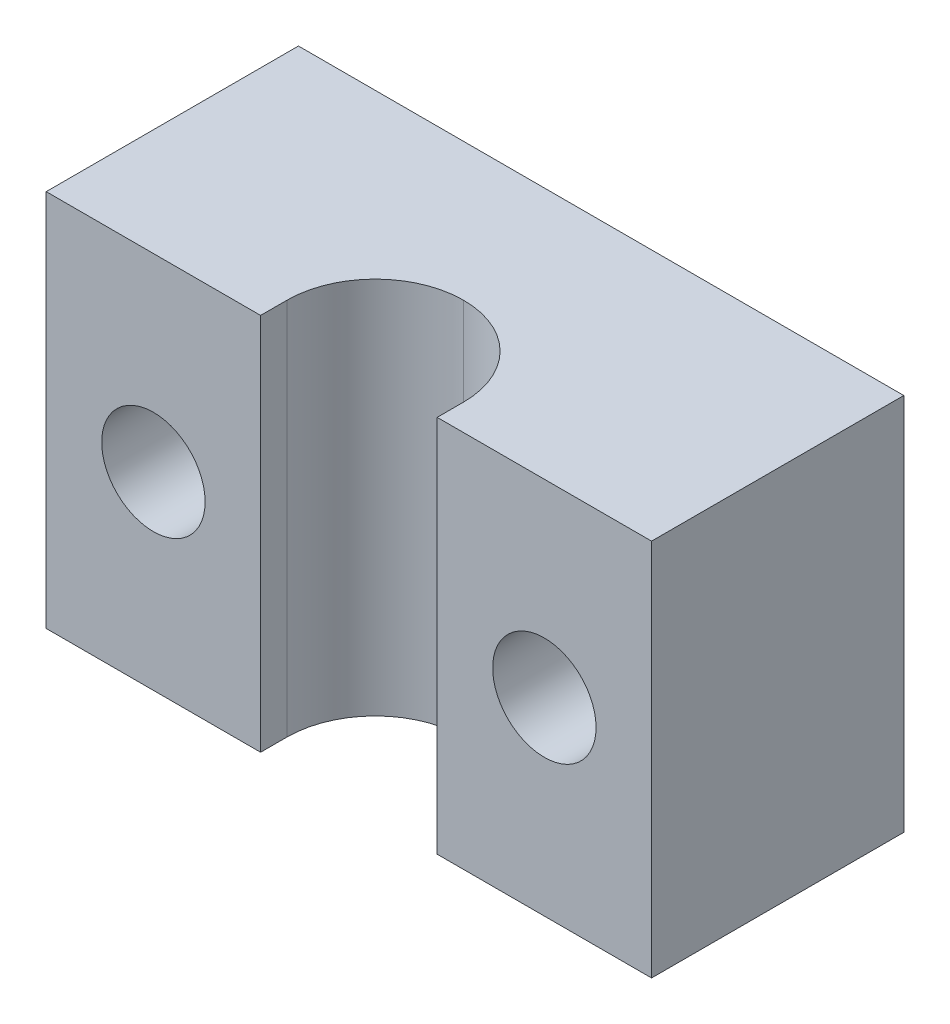
ISO-10303-21;
HEADER;
FILE_DESCRIPTION(('STEP AP214'),'2;1');
FILE_NAME('part.step','',(''),(''),'','','');
FILE_SCHEMA(('AUTOMOTIVE_DESIGN { 1 0 10303 214 1 1 1 1 }'));
ENDSEC;
DATA;
#1=APPLICATION_CONTEXT('core data for automotive mechanical design processes');
#2=APPLICATION_PROTOCOL_DEFINITION('international standard','automotive_design',2000,#1);
#3=PRODUCT_CONTEXT('',#1,'mechanical');
#4=PRODUCT('Part','Part','',(#3));
#5=PRODUCT_RELATED_PRODUCT_CATEGORY('part','',(#4));
#6=PRODUCT_DEFINITION_FORMATION('','',#4);
#7=PRODUCT_DEFINITION_CONTEXT('part definition',#1,'design');
#8=PRODUCT_DEFINITION('design','',#6,#7);
#9=PRODUCT_DEFINITION_SHAPE('','',#8);
#10=(LENGTH_UNIT() NAMED_UNIT(*) SI_UNIT(.MILLI.,.METRE.));
#11=(NAMED_UNIT(*) PLANE_ANGLE_UNIT() SI_UNIT($,.RADIAN.));
#12=(NAMED_UNIT(*) SI_UNIT($,.STERADIAN.) SOLID_ANGLE_UNIT());
#13=UNCERTAINTY_MEASURE_WITH_UNIT(LENGTH_MEASURE(1.E-05),#10,'distance_accuracy_value','');
#14=(GEOMETRIC_REPRESENTATION_CONTEXT(3) GLOBAL_UNCERTAINTY_ASSIGNED_CONTEXT((#13)) GLOBAL_UNIT_ASSIGNED_CONTEXT((#10,
#11,#12)) REPRESENTATION_CONTEXT('',''));
#15=CARTESIAN_POINT('',(0.,0.,0.));
#16=DIRECTION('',(0.,0.,1.));
#17=DIRECTION('',(1.,0.,0.));
#18=AXIS2_PLACEMENT_3D('',#15,#16,#17);
#19=CARTESIAN_POINT('',(-22.986013986014,30.,-8.6013986013986));
#20=DIRECTION('',(1.,0.,0.));
#21=DIRECTION('',(0.,0.,-1.));
#22=AXIS2_PLACEMENT_3D('',#19,#20,#21);
#23=PLANE('',#22);
#24=DIRECTION('',(0.,0.,1.));
#25=VECTOR('',#24,1.);
#26=CARTESIAN_POINT('',(-22.986013986014,0.,-8.6013986013986));
#27=LINE('',#26,#25);
#28=CARTESIAN_POINT('',(-22.986013986014,0.,-8.6013986013986));
#29=VERTEX_POINT('',#28);
#30=CARTESIAN_POINT('',(-22.986013986014,0.,11.3986013986014));
#31=VERTEX_POINT('',#30);
#32=EDGE_CURVE('E175',#29,#31,#27,.T.);
#33=ORIENTED_EDGE('',*,*,#32,.T.);
#34=DIRECTION('',(0.,-1.,0.));
#35=VECTOR('',#34,1.);
#36=CARTESIAN_POINT('',(-22.986013986014,30.,11.3986013986014));
#37=LINE('',#36,#35);
#38=CARTESIAN_POINT('',(-22.986013986014,30.,11.3986013986014));
#39=VERTEX_POINT('',#38);
#40=EDGE_CURVE('E111',#39,#31,#37,.T.);
#41=ORIENTED_EDGE('',*,*,#40,.F.);
#42=DIRECTION('',(0.,0.,1.));
#43=VECTOR('',#42,1.);
#44=CARTESIAN_POINT('',(-22.986013986014,30.,-8.6013986013986));
#45=LINE('',#44,#43);
#46=CARTESIAN_POINT('',(-22.986013986014,30.,-8.6013986013986));
#47=VERTEX_POINT('',#46);
#48=EDGE_CURVE('E106',#47,#39,#45,.T.);
#49=ORIENTED_EDGE('',*,*,#48,.F.);
#50=DIRECTION('',(0.,-1.,0.));
#51=VECTOR('',#50,1.);
#52=CARTESIAN_POINT('',(-22.986013986014,30.,-8.6013986013986));
#53=LINE('',#52,#51);
#54=EDGE_CURVE('E109',#47,#29,#53,.T.);
#55=ORIENTED_EDGE('',*,*,#54,.T.);
#56=EDGE_LOOP('',(#33,#41,#49,#55));
#57=FACE_BOUND('',#56,.T.);
#58=ADVANCED_FACE('F35',(#57),#23,.F.);
#59=CARTESIAN_POINT('',(-22.986013986014,30.,11.3986013986014));
#60=DIRECTION('',(0.,0.,-1.));
#61=DIRECTION('',(-1.,0.,0.));
#62=AXIS2_PLACEMENT_3D('',#59,#60,#61);
#63=PLANE('',#62);
#64=CARTESIAN_POINT('',(-14.486013986014,15.,11.3986013986014));
#65=DIRECTION('',(0.,0.,1.));
#66=DIRECTION('',(1.,0.,0.));
#67=AXIS2_PLACEMENT_3D('',#64,#65,#66);
#68=CIRCLE('',#67,4.1);
#69=CARTESIAN_POINT('',(-10.386013986014,15.,11.3986013986014));
#70=VERTEX_POINT('',#69);
#71=EDGE_CURVE('E140',#70,#70,#68,.T.);
#72=ORIENTED_EDGE('',*,*,#71,.F.);
#73=EDGE_LOOP('',(#72));
#74=FACE_BOUND('',#73,.T.);
#75=DIRECTION('',(1.,0.,0.));
#76=VECTOR('',#75,1.);
#77=CARTESIAN_POINT('',(-22.986013986014,0.,11.3986013986014));
#78=LINE('',#77,#76);
#79=CARTESIAN_POINT('',(-5.98601398601399,0.,11.3986013986014));
#80=VERTEX_POINT('',#79);
#81=EDGE_CURVE('E162',#31,#80,#78,.T.);
#82=ORIENTED_EDGE('',*,*,#81,.T.);
#83=DIRECTION('',(0.,-1.,0.));
#84=VECTOR('',#83,1.);
#85=CARTESIAN_POINT('',(-5.98601398601399,30.,11.3986013986014));
#86=LINE('',#85,#84);
#87=CARTESIAN_POINT('',(-5.98601398601399,30.,11.3986013986014));
#88=VERTEX_POINT('',#87);
#89=EDGE_CURVE('E134',#88,#80,#86,.T.);
#90=ORIENTED_EDGE('',*,*,#89,.F.);
#91=DIRECTION('',(1.,0.,0.));
#92=VECTOR('',#91,1.);
#93=CARTESIAN_POINT('',(-22.986013986014,30.,11.3986013986014));
#94=LINE('',#93,#92);
#95=EDGE_CURVE('E113',#39,#88,#94,.T.);
#96=ORIENTED_EDGE('',*,*,#95,.F.);
#97=ORIENTED_EDGE('',*,*,#40,.T.);
#98=EDGE_LOOP('',(#82,#90,#96,#97));
#99=FACE_BOUND('',#98,.T.);
#100=ADVANCED_FACE('F223',(#74,#99),#63,.F.);
#101=CARTESIAN_POINT('',(-5.98601398601399,30.,11.3986013986014));
#102=DIRECTION('',(-1.,0.,0.));
#103=DIRECTION('',(0.,0.,1.));
#104=AXIS2_PLACEMENT_3D('',#101,#102,#103);
#105=PLANE('',#104);
#106=DIRECTION('',(0.,0.,-1.));
#107=VECTOR('',#106,1.);
#108=CARTESIAN_POINT('',(-5.98601398601399,0.,11.3986013986014));
#109=LINE('',#108,#107);
#110=CARTESIAN_POINT('',(-5.98601398601399,0.,9.30769230769231));
#111=VERTEX_POINT('',#110);
#112=EDGE_CURVE('E152',#80,#111,#109,.T.);
#113=ORIENTED_EDGE('',*,*,#112,.T.);
#114=DIRECTION('',(0.,-1.,0.));
#115=VECTOR('',#114,1.);
#116=CARTESIAN_POINT('',(-5.98601398601399,30.,9.30769230769231));
#117=LINE('',#116,#115);
#118=CARTESIAN_POINT('',(-5.98601398601399,30.,9.30769230769231));
#119=VERTEX_POINT('',#118);
#120=EDGE_CURVE('E129',#111,#119,#117,.F.);
#121=ORIENTED_EDGE('',*,*,#120,.T.);
#122=DIRECTION('',(0.,0.,-1.));
#123=VECTOR('',#122,1.);
#124=CARTESIAN_POINT('',(-5.98601398601399,30.,11.3986013986014));
#125=LINE('',#124,#123);
#126=EDGE_CURVE('E178',#88,#119,#125,.T.);
#127=ORIENTED_EDGE('',*,*,#126,.F.);
#128=ORIENTED_EDGE('',*,*,#89,.T.);
#129=EDGE_LOOP('',(#113,#121,#127,#128));
#130=FACE_BOUND('',#129,.T.);
#131=ADVANCED_FACE('F158',(#130),#105,.F.);
#132=CARTESIAN_POINT('',(8.01398601398601,30.,2.30769230769231));
#133=DIRECTION('',(1.,0.,0.));
#134=DIRECTION('',(0.,0.,-1.));
#135=AXIS2_PLACEMENT_3D('',#132,#133,#134);
#136=PLANE('',#135);
#137=DIRECTION('',(0.,0.,1.));
#138=VECTOR('',#137,1.);
#139=CARTESIAN_POINT('',(8.01398601398601,30.,2.30769230769231));
#140=LINE('',#139,#138);
#141=CARTESIAN_POINT('',(8.01398601398601,30.,9.30769230769231));
#142=VERTEX_POINT('',#141);
#143=CARTESIAN_POINT('',(8.01398601398601,30.,11.3986013986014));
#144=VERTEX_POINT('',#143);
#145=EDGE_CURVE('E180',#142,#144,#140,.T.);
#146=ORIENTED_EDGE('',*,*,#145,.F.);
#147=DIRECTION('',(0.,-1.,0.));
#148=VECTOR('',#147,1.);
#149=CARTESIAN_POINT('',(8.01398601398601,0.,9.30769230769231));
#150=LINE('',#149,#148);
#151=CARTESIAN_POINT('',(8.01398601398601,0.,9.30769230769231));
#152=VERTEX_POINT('',#151);
#153=EDGE_CURVE('E132',#142,#152,#150,.T.);
#154=ORIENTED_EDGE('',*,*,#153,.T.);
#155=DIRECTION('',(0.,0.,1.));
#156=VECTOR('',#155,1.);
#157=CARTESIAN_POINT('',(8.01398601398601,0.,2.30769230769231));
#158=LINE('',#157,#156);
#159=CARTESIAN_POINT('',(8.01398601398601,0.,11.3986013986014));
#160=VERTEX_POINT('',#159);
#161=EDGE_CURVE('E161',#152,#160,#158,.T.);
#162=ORIENTED_EDGE('',*,*,#161,.T.);
#163=DIRECTION('',(0.,-1.,0.));
#164=VECTOR('',#163,1.);
#165=CARTESIAN_POINT('',(8.01398601398601,30.,11.3986013986014));
#166=LINE('',#165,#164);
#167=EDGE_CURVE('E198',#144,#160,#166,.T.);
#168=ORIENTED_EDGE('',*,*,#167,.F.);
#169=EDGE_LOOP('',(#146,#154,#162,#168));
#170=FACE_BOUND('',#169,.T.);
#171=ADVANCED_FACE('F219',(#170),#136,.F.);
#172=CARTESIAN_POINT('',(8.01398601398601,30.,11.3986013986014));
#173=DIRECTION('',(0.,0.,-1.));
#174=DIRECTION('',(-1.,0.,0.));
#175=AXIS2_PLACEMENT_3D('',#172,#173,#174);
#176=PLANE('',#175);
#177=CARTESIAN_POINT('',(16.513986013986,15.,11.3986013986014));
#178=DIRECTION('',(0.,0.,1.));
#179=DIRECTION('',(1.,0.,0.));
#180=AXIS2_PLACEMENT_3D('',#177,#178,#179);
#181=CIRCLE('',#180,4.1);
#182=CARTESIAN_POINT('',(20.613986013986,15.,11.3986013986014));
#183=VERTEX_POINT('',#182);
#184=EDGE_CURVE('E141',#183,#183,#181,.T.);
#185=ORIENTED_EDGE('',*,*,#184,.F.);
#186=EDGE_LOOP('',(#185));
#187=FACE_BOUND('',#186,.T.);
#188=DIRECTION('',(1.,0.,0.));
#189=VECTOR('',#188,1.);
#190=CARTESIAN_POINT('',(8.01398601398601,0.,11.3986013986014));
#191=LINE('',#190,#189);
#192=CARTESIAN_POINT('',(25.013986013986,0.,11.3986013986014));
#193=VERTEX_POINT('',#192);
#194=EDGE_CURVE('E189',#160,#193,#191,.T.);
#195=ORIENTED_EDGE('',*,*,#194,.T.);
#196=DIRECTION('',(0.,-1.,0.));
#197=VECTOR('',#196,1.);
#198=CARTESIAN_POINT('',(25.013986013986,30.,11.3986013986014));
#199=LINE('',#198,#197);
#200=CARTESIAN_POINT('',(25.013986013986,30.,11.3986013986014));
#201=VERTEX_POINT('',#200);
#202=EDGE_CURVE('E195',#201,#193,#199,.T.);
#203=ORIENTED_EDGE('',*,*,#202,.F.);
#204=DIRECTION('',(1.,0.,0.));
#205=VECTOR('',#204,1.);
#206=CARTESIAN_POINT('',(8.01398601398601,30.,11.3986013986014));
#207=LINE('',#206,#205);
#208=EDGE_CURVE('E182',#144,#201,#207,.T.);
#209=ORIENTED_EDGE('',*,*,#208,.F.);
#210=ORIENTED_EDGE('',*,*,#167,.T.);
#211=EDGE_LOOP('',(#195,#203,#209,#210));
#212=FACE_BOUND('',#211,.T.);
#213=ADVANCED_FACE('F204',(#187,#212),#176,.F.);
#214=CARTESIAN_POINT('',(25.013986013986,30.,11.3986013986014));
#215=DIRECTION('',(-1.,0.,0.));
#216=DIRECTION('',(0.,0.,1.));
#217=AXIS2_PLACEMENT_3D('',#214,#215,#216);
#218=PLANE('',#217);
#219=DIRECTION('',(0.,0.,-1.));
#220=VECTOR('',#219,1.);
#221=CARTESIAN_POINT('',(25.013986013986,0.,11.3986013986014));
#222=LINE('',#221,#220);
#223=CARTESIAN_POINT('',(25.013986013986,0.,-8.6013986013986));
#224=VERTEX_POINT('',#223);
#225=EDGE_CURVE('E191',#193,#224,#222,.T.);
#226=ORIENTED_EDGE('',*,*,#225,.T.);
#227=DIRECTION('',(0.,-1.,0.));
#228=VECTOR('',#227,1.);
#229=CARTESIAN_POINT('',(25.013986013986,30.,-8.6013986013986));
#230=LINE('',#229,#228);
#231=CARTESIAN_POINT('',(25.013986013986,30.,-8.6013986013986));
#232=VERTEX_POINT('',#231);
#233=EDGE_CURVE('E185',#232,#224,#230,.T.);
#234=ORIENTED_EDGE('',*,*,#233,.F.);
#235=DIRECTION('',(0.,0.,-1.));
#236=VECTOR('',#235,1.);
#237=CARTESIAN_POINT('',(25.013986013986,30.,11.3986013986014));
#238=LINE('',#237,#236);
#239=EDGE_CURVE('E119',#201,#232,#238,.T.);
#240=ORIENTED_EDGE('',*,*,#239,.F.);
#241=ORIENTED_EDGE('',*,*,#202,.T.);
#242=EDGE_LOOP('',(#226,#234,#240,#241));
#243=FACE_BOUND('',#242,.T.);
#244=ADVANCED_FACE('F210',(#243),#218,.F.);
#245=CARTESIAN_POINT('',(25.013986013986,30.,-8.6013986013986));
#246=DIRECTION('',(0.,0.,1.));
#247=DIRECTION('',(1.,0.,0.));
#248=AXIS2_PLACEMENT_3D('',#245,#246,#247);
#249=PLANE('',#248);
#250=CARTESIAN_POINT('',(16.513986013986,15.,-8.6013986013986));
#251=DIRECTION('',(0.,0.,1.));
#252=DIRECTION('',(1.,0.,0.));
#253=AXIS2_PLACEMENT_3D('',#250,#251,#252);
#254=CIRCLE('',#253,4.1);
#255=CARTESIAN_POINT('',(20.613986013986,15.,-8.6013986013986));
#256=VERTEX_POINT('',#255);
#257=EDGE_CURVE('E138',#256,#256,#254,.T.);
#258=ORIENTED_EDGE('',*,*,#257,.T.);
#259=EDGE_LOOP('',(#258));
#260=FACE_BOUND('',#259,.T.);
#261=DIRECTION('',(-1.,0.,0.));
#262=VECTOR('',#261,1.);
#263=CARTESIAN_POINT('',(25.013986013986,0.,-8.6013986013986));
#264=LINE('',#263,#262);
#265=EDGE_CURVE('E123',#224,#29,#264,.T.);
#266=ORIENTED_EDGE('',*,*,#265,.T.);
#267=ORIENTED_EDGE('',*,*,#54,.F.);
#268=DIRECTION('',(-1.,0.,0.));
#269=VECTOR('',#268,1.);
#270=CARTESIAN_POINT('',(-3.98601398601399,30.,-8.6013986013986));
#271=LINE('',#270,#269);
#272=EDGE_CURVE('E114',#232,#47,#271,.T.);
#273=ORIENTED_EDGE('',*,*,#272,.F.);
#274=ORIENTED_EDGE('',*,*,#233,.T.);
#275=EDGE_LOOP('',(#266,#267,#273,#274));
#276=FACE_BOUND('',#275,.T.);
#277=CARTESIAN_POINT('',(-14.486013986014,15.,-8.6013986013986));
#278=DIRECTION('',(0.,0.,1.));
#279=DIRECTION('',(1.,0.,0.));
#280=AXIS2_PLACEMENT_3D('',#277,#278,#279);
#281=CIRCLE('',#280,4.1);
#282=CARTESIAN_POINT('',(-10.386013986014,15.,-8.6013986013986));
#283=VERTEX_POINT('',#282);
#284=EDGE_CURVE('E173',#283,#283,#281,.T.);
#285=ORIENTED_EDGE('',*,*,#284,.T.);
#286=EDGE_LOOP('',(#285));
#287=FACE_BOUND('',#286,.T.);
#288=ADVANCED_FACE('F125',(#260,#276,#287),#249,.F.);
#289=CARTESIAN_POINT('',(0.,30.,0.));
#290=DIRECTION('',(0.,1.,0.));
#291=DIRECTION('',(0.,0.,1.));
#292=AXIS2_PLACEMENT_3D('',#289,#290,#291);
#293=PLANE('',#292);
#294=ORIENTED_EDGE('',*,*,#239,.T.);
#295=ORIENTED_EDGE('',*,*,#272,.T.);
#296=ORIENTED_EDGE('',*,*,#48,.T.);
#297=ORIENTED_EDGE('',*,*,#95,.T.);
#298=ORIENTED_EDGE('',*,*,#126,.T.);
#299=CARTESIAN_POINT('',(1.01398601398601,30.,9.30769230769231));
#300=DIRECTION('',(0.,1.,0.));
#301=DIRECTION('',(0.,0.,1.));
#302=AXIS2_PLACEMENT_3D('',#299,#300,#301);
#303=CIRCLE('',#302,7.);
#304=CARTESIAN_POINT('',(1.01398601398601,30.,2.30769230769231));
#305=VERTEX_POINT('',#304);
#306=EDGE_CURVE('E50',#119,#305,#303,.F.);
#307=ORIENTED_EDGE('',*,*,#306,.T.);
#308=CARTESIAN_POINT('',(1.01398601398601,30.,9.30769230769231));
#309=DIRECTION('',(0.,1.,0.));
#310=DIRECTION('',(0.,0.,1.));
#311=AXIS2_PLACEMENT_3D('',#308,#309,#310);
#312=CIRCLE('',#311,7.);
#313=EDGE_CURVE('E11',#305,#142,#312,.F.);
#314=ORIENTED_EDGE('',*,*,#313,.T.);
#315=ORIENTED_EDGE('',*,*,#145,.T.);
#316=ORIENTED_EDGE('',*,*,#208,.T.);
#317=EDGE_LOOP('',(#294,#295,#296,#297,#298,#307,#314,#315,#316));
#318=FACE_BOUND('',#317,.T.);
#319=ADVANCED_FACE('F117',(#318),#293,.T.);
#320=CARTESIAN_POINT('',(0.,0.,0.));
#321=DIRECTION('',(0.,1.,0.));
#322=DIRECTION('',(0.,0.,1.));
#323=AXIS2_PLACEMENT_3D('',#320,#321,#322);
#324=PLANE('',#323);
#325=ORIENTED_EDGE('',*,*,#32,.F.);
#326=ORIENTED_EDGE('',*,*,#265,.F.);
#327=ORIENTED_EDGE('',*,*,#225,.F.);
#328=ORIENTED_EDGE('',*,*,#194,.F.);
#329=ORIENTED_EDGE('',*,*,#161,.F.);
#330=CARTESIAN_POINT('',(1.01398601398601,0.,9.30769230769231));
#331=DIRECTION('',(0.,1.,0.));
#332=DIRECTION('',(0.,0.,1.));
#333=AXIS2_PLACEMENT_3D('',#330,#331,#332);
#334=CIRCLE('',#333,7.);
#335=CARTESIAN_POINT('',(1.01398601398601,0.,2.30769230769231));
#336=VERTEX_POINT('',#335);
#337=EDGE_CURVE('E44',#152,#336,#334,.T.);
#338=ORIENTED_EDGE('',*,*,#337,.T.);
#339=CARTESIAN_POINT('',(1.01398601398601,0.,9.30769230769231));
#340=DIRECTION('',(0.,1.,0.));
#341=DIRECTION('',(0.,0.,1.));
#342=AXIS2_PLACEMENT_3D('',#339,#340,#341);
#343=CIRCLE('',#342,7.);
#344=EDGE_CURVE('E144',#336,#111,#343,.T.);
#345=ORIENTED_EDGE('',*,*,#344,.T.);
#346=ORIENTED_EDGE('',*,*,#112,.F.);
#347=ORIENTED_EDGE('',*,*,#81,.F.);
#348=EDGE_LOOP('',(#325,#326,#327,#328,#329,#338,#345,#346,#347));
#349=FACE_BOUND('',#348,.T.);
#350=ADVANCED_FACE('F150',(#349),#324,.F.);
#351=CARTESIAN_POINT('',(-14.486013986014,15.,-58.6013986013986));
#352=DIRECTION('',(0.,0.,1.));
#353=DIRECTION('',(1.,0.,0.));
#354=AXIS2_PLACEMENT_3D('',#351,#352,#353);
#355=CYLINDRICAL_SURFACE('',#354,4.1);
#356=ORIENTED_EDGE('',*,*,#71,.T.);
#357=EDGE_LOOP('',(#356));
#358=FACE_BOUND('',#357,.T.);
#359=ORIENTED_EDGE('',*,*,#284,.F.);
#360=EDGE_LOOP('',(#359));
#361=FACE_BOUND('',#360,.T.);
#362=ADVANCED_FACE('F239',(#358,#361),#355,.F.);
#363=CARTESIAN_POINT('',(16.513986013986,15.,-58.6013986013986));
#364=DIRECTION('',(0.,0.,1.));
#365=DIRECTION('',(1.,0.,0.));
#366=AXIS2_PLACEMENT_3D('',#363,#364,#365);
#367=CYLINDRICAL_SURFACE('',#366,4.1);
#368=ORIENTED_EDGE('',*,*,#184,.T.);
#369=EDGE_LOOP('',(#368));
#370=FACE_BOUND('',#369,.T.);
#371=ORIENTED_EDGE('',*,*,#257,.F.);
#372=EDGE_LOOP('',(#371));
#373=FACE_BOUND('',#372,.T.);
#374=ADVANCED_FACE('F235',(#370,#373),#367,.F.);
#375=CARTESIAN_POINT('',(1.01398601398601,30.,9.30769230769231));
#376=DIRECTION('',(0.,1.,0.));
#377=DIRECTION('',(0.,0.,1.));
#378=AXIS2_PLACEMENT_3D('',#375,#376,#377);
#379=CYLINDRICAL_SURFACE('',#378,7.);
#380=ORIENTED_EDGE('',*,*,#153,.F.);
#381=ORIENTED_EDGE('',*,*,#313,.F.);
#382=DIRECTION('',(0.,-1.,0.));
#383=VECTOR('',#382,1.);
#384=CARTESIAN_POINT('',(1.01398601398601,30.,2.30769230769231));
#385=LINE('',#384,#383);
#386=EDGE_CURVE('E39',#336,#305,#385,.F.);
#387=ORIENTED_EDGE('',*,*,#386,.F.);
#388=ORIENTED_EDGE('',*,*,#337,.F.);
#389=EDGE_LOOP('',(#380,#381,#387,#388));
#390=FACE_BOUND('',#389,.T.);
#391=ADVANCED_FACE('F37',(#390),#379,.F.);
#392=CARTESIAN_POINT('',(1.01398601398601,30.,9.30769230769231));
#393=DIRECTION('',(0.,1.,0.));
#394=DIRECTION('',(0.,0.,1.));
#395=AXIS2_PLACEMENT_3D('',#392,#393,#394);
#396=CYLINDRICAL_SURFACE('',#395,7.);
#397=ORIENTED_EDGE('',*,*,#306,.F.);
#398=ORIENTED_EDGE('',*,*,#120,.F.);
#399=ORIENTED_EDGE('',*,*,#344,.F.);
#400=ORIENTED_EDGE('',*,*,#386,.T.);
#401=EDGE_LOOP('',(#397,#398,#399,#400));
#402=FACE_BOUND('',#401,.T.);
#403=ADVANCED_FACE('F164',(#402),#396,.F.);
#404=CLOSED_SHELL('',(#58,#100,#131,#171,#213,#244,#288,#319,#350,#362,#374,#391,#403));
#405=MANIFOLD_SOLID_BREP('B2',#404);
#406=ADVANCED_BREP_SHAPE_REPRESENTATION('',(#18,#405),#14);
#407=SHAPE_DEFINITION_REPRESENTATION(#9,#406);
ENDSEC;
END-ISO-10303-21;
